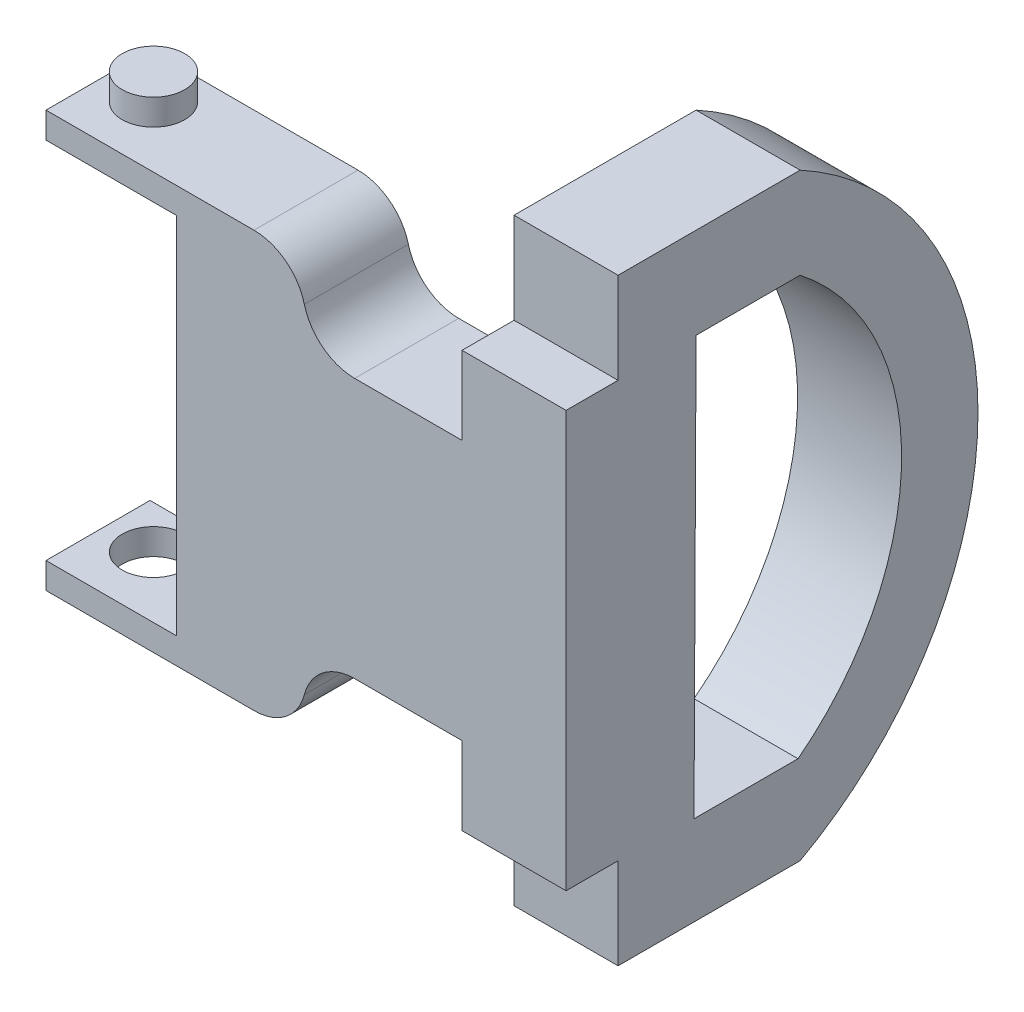
ISO-10303-21;
HEADER;
FILE_DESCRIPTION(('STEP AP214'),'2;1');
FILE_NAME('part.step','',(''),(''),'','','');
FILE_SCHEMA(('AUTOMOTIVE_DESIGN { 1 0 10303 214 1 1 1 1 }'));
ENDSEC;
DATA;
#1=APPLICATION_CONTEXT('core data for automotive mechanical design processes');
#2=APPLICATION_PROTOCOL_DEFINITION('international standard','automotive_design',2000,#1);
#3=PRODUCT_CONTEXT('',#1,'mechanical');
#4=PRODUCT('Part','Part','',(#3));
#5=PRODUCT_RELATED_PRODUCT_CATEGORY('part','',(#4));
#6=PRODUCT_DEFINITION_FORMATION('','',#4);
#7=PRODUCT_DEFINITION_CONTEXT('part definition',#1,'design');
#8=PRODUCT_DEFINITION('design','',#6,#7);
#9=PRODUCT_DEFINITION_SHAPE('','',#8);
#10=(LENGTH_UNIT() NAMED_UNIT(*) SI_UNIT(.MILLI.,.METRE.));
#11=(NAMED_UNIT(*) PLANE_ANGLE_UNIT() SI_UNIT($,.RADIAN.));
#12=(NAMED_UNIT(*) SI_UNIT($,.STERADIAN.) SOLID_ANGLE_UNIT());
#13=UNCERTAINTY_MEASURE_WITH_UNIT(LENGTH_MEASURE(1.E-05),#10,'distance_accuracy_value','');
#14=(GEOMETRIC_REPRESENTATION_CONTEXT(3) GLOBAL_UNCERTAINTY_ASSIGNED_CONTEXT((#13)) GLOBAL_UNIT_ASSIGNED_CONTEXT((#10,
#11,#12)) REPRESENTATION_CONTEXT('',''));
#15=CARTESIAN_POINT('',(0.,0.,0.));
#16=DIRECTION('',(0.,0.,1.));
#17=DIRECTION('',(1.,0.,0.));
#18=AXIS2_PLACEMENT_3D('',#15,#16,#17);
#19=CARTESIAN_POINT('',(20.,-17.6610059550138,-10.));
#20=DIRECTION('',(0.,-1.,0.));
#21=DIRECTION('',(0.,0.,-1.));
#22=AXIS2_PLACEMENT_3D('',#19,#20,#21);
#23=PLANE('',#22);
#24=DIRECTION('',(0.,0.,1.));
#25=VECTOR('',#24,1.);
#26=CARTESIAN_POINT('',(0.,-17.6610059550138,-10.));
#27=LINE('',#26,#25);
#28=CARTESIAN_POINT('',(0.,-17.6610059550138,-10.));
#29=VERTEX_POINT('',#28);
#30=CARTESIAN_POINT('',(0.,-17.6610059550138,0.));
#31=VERTEX_POINT('',#30);
#32=EDGE_CURVE('E394',#29,#31,#27,.T.);
#33=ORIENTED_EDGE('',*,*,#32,.T.);
#34=DIRECTION('',(-1.,0.,0.));
#35=VECTOR('',#34,1.);
#36=CARTESIAN_POINT('',(20.,-17.6610059550138,0.));
#37=LINE('',#36,#35);
#38=CARTESIAN_POINT('',(20.,-17.6610059550138,0.));
#39=VERTEX_POINT('',#38);
#40=EDGE_CURVE('E486',#39,#31,#37,.T.);
#41=ORIENTED_EDGE('',*,*,#40,.F.);
#42=DIRECTION('',(0.,0.,1.));
#43=VECTOR('',#42,1.);
#44=CARTESIAN_POINT('',(20.,-17.6610059550138,-10.));
#45=LINE('',#44,#43);
#46=CARTESIAN_POINT('',(20.,-17.6610059550138,-10.));
#47=VERTEX_POINT('',#46);
#48=EDGE_CURVE('E404',#47,#39,#45,.T.);
#49=ORIENTED_EDGE('',*,*,#48,.F.);
#50=DIRECTION('',(-1.,0.,0.));
#51=VECTOR('',#50,1.);
#52=CARTESIAN_POINT('',(20.,-17.6610059550138,-10.));
#53=LINE('',#52,#51);
#54=EDGE_CURVE('E434',#47,#29,#53,.T.);
#55=ORIENTED_EDGE('',*,*,#54,.T.);
#56=EDGE_LOOP('',(#33,#41,#49,#55));
#57=FACE_BOUND('',#56,.T.);
#58=ADVANCED_FACE('F42',(#57),#23,.F.);
#59=CARTESIAN_POINT('',(20.,-17.6610059550138,0.));
#60=DIRECTION('',(0.,0.,-1.));
#61=DIRECTION('',(0.,1.,0.));
#62=AXIS2_PLACEMENT_3D('',#59,#60,#61);
#63=PLANE('',#62);
#64=DIRECTION('',(0.00442729320585626,-0.99999019948941,0.));
#65=VECTOR('',#64,1.);
#66=CARTESIAN_POINT('',(-80.0000000000002,-17.6610059550114,0.));
#67=LINE('',#66,#65);
#68=CARTESIAN_POINT('',(-80.0000000000002,-17.6610059550114,0.));
#69=VERTEX_POINT('',#68);
#70=CARTESIAN_POINT('',(-79.9778633170201,-22.6610059550114,0.));
#71=VERTEX_POINT('',#70);
#72=EDGE_CURVE('E232',#69,#71,#67,.T.);
#73=ORIENTED_EDGE('',*,*,#72,.T.);
#74=DIRECTION('',(-1.,0.,0.));
#75=VECTOR('',#74,1.);
#76=CARTESIAN_POINT('',(-83.4960278519465,-22.6610059550114,0.));
#77=LINE('',#76,#75);
#78=CARTESIAN_POINT('',(-54.9335906019123,-22.6610059550114,0.));
#79=VERTEX_POINT('',#78);
#80=EDGE_CURVE('E226',#79,#71,#77,.T.);
#81=ORIENTED_EDGE('',*,*,#80,.F.);
#82=DIRECTION('',(0.,1.,0.));
#83=VECTOR('',#82,1.);
#84=CARTESIAN_POINT('',(-54.9335906019123,-82.6610059549785,0.));
#85=LINE('',#84,#83);
#86=CARTESIAN_POINT('',(-54.9335906019123,-92.6610059550144,0.));
#87=VERTEX_POINT('',#86);
#88=EDGE_CURVE('E219',#87,#79,#85,.T.);
#89=ORIENTED_EDGE('',*,*,#88,.F.);
#90=DIRECTION('',(1.,0.,0.));
#91=VECTOR('',#90,1.);
#92=CARTESIAN_POINT('',(-84.9059264365906,-92.6610059550144,0.));
#93=LINE('',#92,#91);
#94=CARTESIAN_POINT('',(-80.,-92.6610059550144,0.));
#95=VERTEX_POINT('',#94);
#96=EDGE_CURVE('E224',#95,#87,#93,.T.);
#97=ORIENTED_EDGE('',*,*,#96,.F.);
#98=DIRECTION('',(0.,-1.,0.));
#99=VECTOR('',#98,1.);
#100=CARTESIAN_POINT('',(-80.,-82.6610059549786,0.));
#101=LINE('',#100,#99);
#102=CARTESIAN_POINT('',(-80.,-97.6610059550144,0.));
#103=VERTEX_POINT('',#102);
#104=EDGE_CURVE('E231',#95,#103,#101,.T.);
#105=ORIENTED_EDGE('',*,*,#104,.T.);
#106=DIRECTION('',(-1.,0.,0.));
#107=VECTOR('',#106,1.);
#108=CARTESIAN_POINT('',(-40.6399999999999,-97.6610059550138,0.));
#109=LINE('',#108,#107);
#110=CARTESIAN_POINT('',(-40.0049167310368,-97.6610059550137,0.));
#111=VERTEX_POINT('',#110);
#112=EDGE_CURVE('E319',#111,#103,#109,.T.);
#113=ORIENTED_EDGE('',*,*,#112,.F.);
#114=CARTESIAN_POINT('',(-40.004916731037,-87.6610059550138,0.));
#115=DIRECTION('',(0.,0.,-1.));
#116=DIRECTION('',(0.,1.,0.));
#117=AXIS2_PLACEMENT_3D('',#114,#115,#116);
#118=CIRCLE('',#117,10.);
#119=CARTESIAN_POINT('',(-30.3224583655184,-90.1610059550138,0.));
#120=VERTEX_POINT('',#119);
#121=EDGE_CURVE('E68',#111,#120,#118,.F.);
#122=ORIENTED_EDGE('',*,*,#121,.T.);
#123=CARTESIAN_POINT('',(-20.6399999999999,-92.6610059550138,0.));
#124=DIRECTION('',(0.,0.,1.));
#125=DIRECTION('',(1.,0.,0.));
#126=AXIS2_PLACEMENT_3D('',#123,#124,#125);
#127=CIRCLE('',#126,10.);
#128=CARTESIAN_POINT('',(-20.64,-82.6610059550138,0.));
#129=VERTEX_POINT('',#128);
#130=EDGE_CURVE('E323',#129,#120,#127,.T.);
#131=ORIENTED_EDGE('',*,*,#130,.F.);
#132=DIRECTION('',(1.,0.,0.));
#133=VECTOR('',#132,1.);
#134=CARTESIAN_POINT('',(-20.64,-82.6610059550138,0.));
#135=LINE('',#134,#133);
#136=CARTESIAN_POINT('',(0.,-82.6610059550138,0.));
#137=VERTEX_POINT('',#136);
#138=EDGE_CURVE('E326',#129,#137,#135,.T.);
#139=ORIENTED_EDGE('',*,*,#138,.T.);
#140=DIRECTION('',(0.,-1.,0.));
#141=VECTOR('',#140,1.);
#142=CARTESIAN_POINT('',(0.,-17.6610059550138,0.));
#143=LINE('',#142,#141);
#144=CARTESIAN_POINT('',(0.,-97.6610059550138,0.));
#145=VERTEX_POINT('',#144);
#146=EDGE_CURVE('E437',#137,#145,#143,.T.);
#147=ORIENTED_EDGE('',*,*,#146,.T.);
#148=DIRECTION('',(-1.,0.,0.));
#149=VECTOR('',#148,1.);
#150=CARTESIAN_POINT('',(20.,-97.6610059550138,0.));
#151=LINE('',#150,#149);
#152=CARTESIAN_POINT('',(20.,-97.6610059550138,0.));
#153=VERTEX_POINT('',#152);
#154=EDGE_CURVE('E482',#153,#145,#151,.T.);
#155=ORIENTED_EDGE('',*,*,#154,.F.);
#156=DIRECTION('',(0.,-1.,0.));
#157=VECTOR('',#156,1.);
#158=CARTESIAN_POINT('',(20.,-17.6610059550138,0.));
#159=LINE('',#158,#157);
#160=EDGE_CURVE('E408',#39,#153,#159,.T.);
#161=ORIENTED_EDGE('',*,*,#160,.F.);
#162=ORIENTED_EDGE('',*,*,#40,.T.);
#163=CARTESIAN_POINT('',(0.,-32.6610059550114,0.));
#164=VERTEX_POINT('',#163);
#165=EDGE_CURVE('E438',#31,#164,#143,.T.);
#166=ORIENTED_EDGE('',*,*,#165,.T.);
#167=DIRECTION('',(-1.,0.,0.));
#168=VECTOR('',#167,1.);
#169=CARTESIAN_POINT('',(0.,-32.6610059550114,0.));
#170=LINE('',#169,#168);
#171=CARTESIAN_POINT('',(-20.6400000000002,-32.6610059550114,0.));
#172=VERTEX_POINT('',#171);
#173=EDGE_CURVE('E329',#164,#172,#170,.T.);
#174=ORIENTED_EDGE('',*,*,#173,.T.);
#175=CARTESIAN_POINT('',(-20.6400000000002,-22.6610059550114,0.));
#176=DIRECTION('',(0.,0.,-1.));
#177=DIRECTION('',(-1.,0.,0.));
#178=AXIS2_PLACEMENT_3D('',#175,#176,#177);
#179=CIRCLE('',#178,10.);
#180=CARTESIAN_POINT('',(-30.3224583655188,-25.1610059550114,0.));
#181=VERTEX_POINT('',#180);
#182=EDGE_CURVE('E333',#172,#181,#179,.T.);
#183=ORIENTED_EDGE('',*,*,#182,.T.);
#184=CARTESIAN_POINT('',(-40.0049167310373,-27.6610059550114,0.));
#185=DIRECTION('',(0.,0.,-1.));
#186=DIRECTION('',(0.,1.,0.));
#187=AXIS2_PLACEMENT_3D('',#184,#185,#186);
#188=CIRCLE('',#187,10.);
#189=CARTESIAN_POINT('',(-40.0049167310373,-17.6610059550114,0.));
#190=VERTEX_POINT('',#189);
#191=EDGE_CURVE('E498',#181,#190,#188,.F.);
#192=ORIENTED_EDGE('',*,*,#191,.T.);
#193=DIRECTION('',(1.,0.,0.));
#194=VECTOR('',#193,1.);
#195=CARTESIAN_POINT('',(-80.0000000000002,-17.6610059550114,0.));
#196=LINE('',#195,#194);
#197=EDGE_CURVE('E285',#69,#190,#196,.T.);
#198=ORIENTED_EDGE('',*,*,#197,.F.);
#199=EDGE_LOOP('',(#73,#81,#89,#97,#105,#113,#122,#131,#139,#147,#155,#161,#162,#166,#174,#183,
#192,#198));
#200=FACE_BOUND('',#199,.T.);
#201=ADVANCED_FACE('F222',(#200),#63,.F.);
#202=CARTESIAN_POINT('',(20.,-97.6610059550138,-10.));
#203=DIRECTION('',(0.,-1.,0.));
#204=DIRECTION('',(0.,0.,-1.));
#205=AXIS2_PLACEMENT_3D('',#202,#203,#204);
#206=PLANE('',#205);
#207=DIRECTION('',(0.,0.,1.));
#208=VECTOR('',#207,1.);
#209=CARTESIAN_POINT('',(0.,-97.6610059550138,-10.));
#210=LINE('',#209,#208);
#211=CARTESIAN_POINT('',(0.,-97.6610059550138,-10.));
#212=VERTEX_POINT('',#211);
#213=EDGE_CURVE('E442',#212,#145,#210,.T.);
#214=ORIENTED_EDGE('',*,*,#213,.F.);
#215=DIRECTION('',(-1.,0.,0.));
#216=VECTOR('',#215,1.);
#217=CARTESIAN_POINT('',(20.,-97.6610059550138,-10.));
#218=LINE('',#217,#216);
#219=CARTESIAN_POINT('',(20.,-97.6610059550138,-10.));
#220=VERTEX_POINT('',#219);
#221=EDGE_CURVE('E479',#220,#212,#218,.T.);
#222=ORIENTED_EDGE('',*,*,#221,.F.);
#223=DIRECTION('',(0.,0.,1.));
#224=VECTOR('',#223,1.);
#225=CARTESIAN_POINT('',(20.,-97.6610059550138,-10.));
#226=LINE('',#225,#224);
#227=EDGE_CURVE('E412',#220,#153,#226,.T.);
#228=ORIENTED_EDGE('',*,*,#227,.T.);
#229=ORIENTED_EDGE('',*,*,#154,.T.);
#230=EDGE_LOOP('',(#214,#222,#228,#229));
#231=FACE_BOUND('',#230,.T.);
#232=ADVANCED_FACE('F543',(#231),#206,.T.);
#233=CARTESIAN_POINT('',(20.,-115.161005955014,-10.));
#234=DIRECTION('',(0.,0.,1.));
#235=DIRECTION('',(1.,0.,0.));
#236=AXIS2_PLACEMENT_3D('',#233,#234,#235);
#237=PLANE('',#236);
#238=DIRECTION('',(0.,1.,0.));
#239=VECTOR('',#238,1.);
#240=CARTESIAN_POINT('',(0.,-115.161005955014,-10.));
#241=LINE('',#240,#239);
#242=CARTESIAN_POINT('',(0.,-115.161005955014,-10.));
#243=VERTEX_POINT('',#242);
#244=EDGE_CURVE('E446',#243,#212,#241,.T.);
#245=ORIENTED_EDGE('',*,*,#244,.F.);
#246=DIRECTION('',(-1.,0.,0.));
#247=VECTOR('',#246,1.);
#248=CARTESIAN_POINT('',(20.,-115.161005955014,-10.));
#249=LINE('',#248,#247);
#250=CARTESIAN_POINT('',(20.,-115.161005955014,-10.));
#251=VERTEX_POINT('',#250);
#252=EDGE_CURVE('E476',#251,#243,#249,.T.);
#253=ORIENTED_EDGE('',*,*,#252,.F.);
#254=DIRECTION('',(0.,1.,0.));
#255=VECTOR('',#254,1.);
#256=CARTESIAN_POINT('',(20.,-115.161005955014,-10.));
#257=LINE('',#256,#255);
#258=EDGE_CURVE('E416',#251,#220,#257,.T.);
#259=ORIENTED_EDGE('',*,*,#258,.T.);
#260=ORIENTED_EDGE('',*,*,#221,.T.);
#261=EDGE_LOOP('',(#245,#253,#259,#260));
#262=FACE_BOUND('',#261,.T.);
#263=ADVANCED_FACE('F659',(#262),#237,.T.);
#264=CARTESIAN_POINT('',(20.,-115.161005955014,-10.));
#265=DIRECTION('',(0.,1.,0.));
#266=DIRECTION('',(0.,0.,1.));
#267=AXIS2_PLACEMENT_3D('',#264,#265,#266);
#268=PLANE('',#267);
#269=DIRECTION('',(0.,0.,-1.));
#270=VECTOR('',#269,1.);
#271=CARTESIAN_POINT('',(0.,-115.161005955014,-10.));
#272=LINE('',#271,#270);
#273=CARTESIAN_POINT('',(0.,-115.161005955014,-45.));
#274=VERTEX_POINT('',#273);
#275=EDGE_CURVE('E450',#243,#274,#272,.T.);
#276=ORIENTED_EDGE('',*,*,#275,.T.);
#277=DIRECTION('',(-1.,0.,0.));
#278=VECTOR('',#277,1.);
#279=CARTESIAN_POINT('',(20.,-115.161005955014,-45.));
#280=LINE('',#279,#278);
#281=CARTESIAN_POINT('',(20.,-115.161005955014,-45.));
#282=VERTEX_POINT('',#281);
#283=EDGE_CURVE('E473',#282,#274,#280,.T.);
#284=ORIENTED_EDGE('',*,*,#283,.F.);
#285=DIRECTION('',(0.,0.,-1.));
#286=VECTOR('',#285,1.);
#287=CARTESIAN_POINT('',(20.,-115.161005955014,-10.));
#288=LINE('',#287,#286);
#289=EDGE_CURVE('E420',#251,#282,#288,.T.);
#290=ORIENTED_EDGE('',*,*,#289,.F.);
#291=ORIENTED_EDGE('',*,*,#252,.T.);
#292=EDGE_LOOP('',(#276,#284,#290,#291));
#293=FACE_BOUND('',#292,.T.);
#294=ADVANCED_FACE('F655',(#293),#268,.F.);
#295=CARTESIAN_POINT('',(20.,-57.6610059550138,-13.7776538357541));
#296=DIRECTION('',(-1.,0.,0.));
#297=DIRECTION('',(0.,0.,1.));
#298=AXIS2_PLACEMENT_3D('',#295,#296,#297);
#299=CYLINDRICAL_SURFACE('',#298,65.43);
#300=CARTESIAN_POINT('',(0.,-57.6610059550138,-13.7776538357541));
#301=DIRECTION('',(-1.,0.,0.));
#302=DIRECTION('',(0.,0.,1.));
#303=AXIS2_PLACEMENT_3D('',#300,#301,#302);
#304=CIRCLE('',#303,65.43);
#305=CARTESIAN_POINT('',(0.,-0.161005955013768,-45.));
#306=VERTEX_POINT('',#305);
#307=EDGE_CURVE('E454',#306,#274,#304,.T.);
#308=ORIENTED_EDGE('',*,*,#307,.F.);
#309=DIRECTION('',(-1.,0.,0.));
#310=VECTOR('',#309,1.);
#311=CARTESIAN_POINT('',(20.,-0.161005955013768,-45.));
#312=LINE('',#311,#310);
#313=CARTESIAN_POINT('',(20.,-0.161005955013768,-45.));
#314=VERTEX_POINT('',#313);
#315=EDGE_CURVE('E470',#314,#306,#312,.T.);
#316=ORIENTED_EDGE('',*,*,#315,.F.);
#317=CARTESIAN_POINT('',(20.,-57.6610059550138,-13.7776538357541));
#318=DIRECTION('',(-1.,0.,0.));
#319=DIRECTION('',(0.,0.,1.));
#320=AXIS2_PLACEMENT_3D('',#317,#318,#319);
#321=CIRCLE('',#320,65.43);
#322=EDGE_CURVE('E423',#314,#282,#321,.T.);
#323=ORIENTED_EDGE('',*,*,#322,.T.);
#324=ORIENTED_EDGE('',*,*,#283,.T.);
#325=EDGE_LOOP('',(#308,#316,#323,#324));
#326=FACE_BOUND('',#325,.T.);
#327=ADVANCED_FACE('F651',(#326),#299,.T.);
#328=CARTESIAN_POINT('',(20.,-0.161005955013768,-10.));
#329=DIRECTION('',(0.,1.,0.));
#330=DIRECTION('',(0.,0.,1.));
#331=AXIS2_PLACEMENT_3D('',#328,#329,#330);
#332=PLANE('',#331);
#333=DIRECTION('',(0.,0.,-1.));
#334=VECTOR('',#333,1.);
#335=CARTESIAN_POINT('',(0.,-0.161005955013768,-10.));
#336=LINE('',#335,#334);
#337=CARTESIAN_POINT('',(0.,-0.161005955013768,-10.));
#338=VERTEX_POINT('',#337);
#339=EDGE_CURVE('E458',#338,#306,#336,.T.);
#340=ORIENTED_EDGE('',*,*,#339,.F.);
#341=DIRECTION('',(-1.,0.,0.));
#342=VECTOR('',#341,1.);
#343=CARTESIAN_POINT('',(20.,-0.161005955013768,-10.));
#344=LINE('',#343,#342);
#345=CARTESIAN_POINT('',(20.,-0.161005955013768,-10.));
#346=VERTEX_POINT('',#345);
#347=EDGE_CURVE('E467',#346,#338,#344,.T.);
#348=ORIENTED_EDGE('',*,*,#347,.F.);
#349=DIRECTION('',(0.,0.,-1.));
#350=VECTOR('',#349,1.);
#351=CARTESIAN_POINT('',(20.,-0.161005955013768,-10.));
#352=LINE('',#351,#350);
#353=EDGE_CURVE('E427',#346,#314,#352,.T.);
#354=ORIENTED_EDGE('',*,*,#353,.T.);
#355=ORIENTED_EDGE('',*,*,#315,.T.);
#356=EDGE_LOOP('',(#340,#348,#354,#355));
#357=FACE_BOUND('',#356,.T.);
#358=ADVANCED_FACE('F647',(#357),#332,.T.);
#359=CARTESIAN_POINT('',(20.,-0.161005955013768,-10.));
#360=DIRECTION('',(0.,0.,-1.));
#361=DIRECTION('',(0.,1.,0.));
#362=AXIS2_PLACEMENT_3D('',#359,#360,#361);
#363=PLANE('',#362);
#364=DIRECTION('',(0.,-1.,0.));
#365=VECTOR('',#364,1.);
#366=CARTESIAN_POINT('',(0.,-0.161005955013768,-10.));
#367=LINE('',#366,#365);
#368=EDGE_CURVE('E409',#338,#29,#367,.T.);
#369=ORIENTED_EDGE('',*,*,#368,.T.);
#370=ORIENTED_EDGE('',*,*,#54,.F.);
#371=DIRECTION('',(0.,-1.,0.));
#372=VECTOR('',#371,1.);
#373=CARTESIAN_POINT('',(20.,-0.161005955013768,-10.));
#374=LINE('',#373,#372);
#375=EDGE_CURVE('E431',#346,#47,#374,.T.);
#376=ORIENTED_EDGE('',*,*,#375,.F.);
#377=ORIENTED_EDGE('',*,*,#347,.T.);
#378=EDGE_LOOP('',(#369,#370,#376,#377));
#379=FACE_BOUND('',#378,.T.);
#380=ADVANCED_FACE('F641',(#379),#363,.F.);
#381=CARTESIAN_POINT('',(20.,-57.6610059550138,-13.7776538357541));
#382=DIRECTION('',(-1.,0.,0.));
#383=DIRECTION('',(0.,0.,1.));
#384=AXIS2_PLACEMENT_3D('',#381,#382,#383);
#385=PLANE('',#384);
#386=ORIENTED_EDGE('',*,*,#227,.F.);
#387=ORIENTED_EDGE('',*,*,#258,.F.);
#388=ORIENTED_EDGE('',*,*,#289,.T.);
#389=ORIENTED_EDGE('',*,*,#322,.F.);
#390=ORIENTED_EDGE('',*,*,#353,.F.);
#391=ORIENTED_EDGE('',*,*,#375,.T.);
#392=ORIENTED_EDGE('',*,*,#48,.T.);
#393=ORIENTED_EDGE('',*,*,#160,.T.);
#394=EDGE_LOOP('',(#386,#387,#388,#389,#390,#391,#392,#393));
#395=FACE_BOUND('',#394,.T.);
#396=DIRECTION('',(0.,0.,-1.));
#397=VECTOR('',#396,1.);
#398=CARTESIAN_POINT('',(20.,-97.970728365294,-44.5990940877306));
#399=LINE('',#398,#397);
#400=CARTESIAN_POINT('',(20.,-97.970728365294,-24.5990940877306));
#401=VERTEX_POINT('',#400);
#402=CARTESIAN_POINT('',(20.,-97.9707283652939,-44.5990940877306));
#403=VERTEX_POINT('',#402);
#404=EDGE_CURVE('E380',#401,#403,#399,.T.);
#405=ORIENTED_EDGE('',*,*,#404,.F.);
#406=DIRECTION('',(0.,-0.999987540214673,0.00499193503645428));
#407=VECTOR('',#406,1.);
#408=CARTESIAN_POINT('',(20.,-17.6610059550138,-25.));
#409=LINE('',#408,#407);
#410=CARTESIAN_POINT('',(20.,-17.6610059550138,-25.));
#411=VERTEX_POINT('',#410);
#412=EDGE_CURVE('E342',#411,#401,#409,.T.);
#413=ORIENTED_EDGE('',*,*,#412,.F.);
#414=DIRECTION('',(0.,0.,1.));
#415=VECTOR('',#414,1.);
#416=CARTESIAN_POINT('',(20.,-17.6610059550138,-45.));
#417=LINE('',#416,#415);
#418=CARTESIAN_POINT('',(20.,-17.6610059550138,-45.));
#419=VERTEX_POINT('',#418);
#420=EDGE_CURVE('E365',#419,#411,#417,.T.);
#421=ORIENTED_EDGE('',*,*,#420,.F.);
#422=CARTESIAN_POINT('',(20.,-57.6610059550138,-13.7776538357541));
#423=DIRECTION('',(1.,0.,0.));
#424=DIRECTION('',(0.,0.,1.));
#425=AXIS2_PLACEMENT_3D('',#422,#423,#424);
#426=CIRCLE('',#425,50.7428310207462);
#427=EDGE_CURVE('E384',#403,#419,#426,.T.);
#428=ORIENTED_EDGE('',*,*,#427,.F.);
#429=EDGE_LOOP('',(#405,#413,#421,#428));
#430=FACE_BOUND('',#429,.T.);
#431=ADVANCED_FACE('F638',(#395,#430),#385,.F.);
#432=CARTESIAN_POINT('',(0.,-57.6610059550138,-13.7776538357541));
#433=DIRECTION('',(-1.,0.,0.));
#434=DIRECTION('',(0.,0.,1.));
#435=AXIS2_PLACEMENT_3D('',#432,#433,#434);
#436=PLANE('',#435);
#437=ORIENTED_EDGE('',*,*,#244,.T.);
#438=ORIENTED_EDGE('',*,*,#213,.T.);
#439=ORIENTED_EDGE('',*,*,#146,.F.);
#440=DIRECTION('',(0.,0.,1.));
#441=VECTOR('',#440,1.);
#442=CARTESIAN_POINT('',(0.,-82.6610059550138,-20.));
#443=LINE('',#442,#441);
#444=CARTESIAN_POINT('',(0.,-82.6610059550138,-20.));
#445=VERTEX_POINT('',#444);
#446=EDGE_CURVE('E350',#445,#137,#443,.T.);
#447=ORIENTED_EDGE('',*,*,#446,.F.);
#448=DIRECTION('',(0.,1.,0.));
#449=VECTOR('',#448,1.);
#450=CARTESIAN_POINT('',(0.,-57.6610059550138,-20.));
#451=LINE('',#450,#449);
#452=CARTESIAN_POINT('',(0.,-32.6610059550114,-20.));
#453=VERTEX_POINT('',#452);
#454=EDGE_CURVE('E490',#445,#453,#451,.T.);
#455=ORIENTED_EDGE('',*,*,#454,.T.);
#456=DIRECTION('',(0.,0.,1.));
#457=VECTOR('',#456,1.);
#458=CARTESIAN_POINT('',(0.,-32.6610059550114,-20.));
#459=LINE('',#458,#457);
#460=EDGE_CURVE('E346',#453,#164,#459,.T.);
#461=ORIENTED_EDGE('',*,*,#460,.T.);
#462=ORIENTED_EDGE('',*,*,#165,.F.);
#463=ORIENTED_EDGE('',*,*,#32,.F.);
#464=ORIENTED_EDGE('',*,*,#368,.F.);
#465=ORIENTED_EDGE('',*,*,#339,.T.);
#466=ORIENTED_EDGE('',*,*,#307,.T.);
#467=ORIENTED_EDGE('',*,*,#275,.F.);
#468=EDGE_LOOP('',(#437,#438,#439,#447,#455,#461,#462,#463,#464,#465,#466,#467));
#469=FACE_BOUND('',#468,.T.);
#470=DIRECTION('',(0.,-0.999987540214673,0.00499193503645428));
#471=VECTOR('',#470,1.);
#472=CARTESIAN_POINT('',(0.,-17.6610059550138,-25.));
#473=LINE('',#472,#471);
#474=CARTESIAN_POINT('',(0.,-17.6610059550138,-25.));
#475=VERTEX_POINT('',#474);
#476=CARTESIAN_POINT('',(0.,-97.970728365294,-24.5990940877306));
#477=VERTEX_POINT('',#476);
#478=EDGE_CURVE('E360',#475,#477,#473,.T.);
#479=ORIENTED_EDGE('',*,*,#478,.T.);
#480=DIRECTION('',(0.,0.,-1.));
#481=VECTOR('',#480,1.);
#482=CARTESIAN_POINT('',(0.,-97.970728365294,-44.5990940877306));
#483=LINE('',#482,#481);
#484=CARTESIAN_POINT('',(0.,-97.970728365294,-44.5990940877306));
#485=VERTEX_POINT('',#484);
#486=EDGE_CURVE('E364',#477,#485,#483,.T.);
#487=ORIENTED_EDGE('',*,*,#486,.T.);
#488=CARTESIAN_POINT('',(0.,-57.6610059550138,-13.7776538357541));
#489=DIRECTION('',(1.,0.,0.));
#490=DIRECTION('',(0.,0.,1.));
#491=AXIS2_PLACEMENT_3D('',#488,#489,#490);
#492=CIRCLE('',#491,50.7428310207462);
#493=CARTESIAN_POINT('',(0.,-17.6610059550138,-45.));
#494=VERTEX_POINT('',#493);
#495=EDGE_CURVE('E369',#485,#494,#492,.T.);
#496=ORIENTED_EDGE('',*,*,#495,.T.);
#497=DIRECTION('',(0.,0.,1.));
#498=VECTOR('',#497,1.);
#499=CARTESIAN_POINT('',(0.,-17.6610059550138,-45.));
#500=LINE('',#499,#498);
#501=EDGE_CURVE('E373',#494,#475,#500,.T.);
#502=ORIENTED_EDGE('',*,*,#501,.T.);
#503=EDGE_LOOP('',(#479,#487,#496,#502));
#504=FACE_BOUND('',#503,.T.);
#505=ADVANCED_FACE('F572',(#469,#504),#436,.T.);
#506=CARTESIAN_POINT('',(0.,-17.6610059550138,-25.));
#507=DIRECTION('',(0.,0.00499193503645428,0.999987540214673));
#508=DIRECTION('',(0.,-0.999987540214673,0.00499193503645429));
#509=AXIS2_PLACEMENT_3D('',#506,#507,#508);
#510=PLANE('',#509);
#511=ORIENTED_EDGE('',*,*,#412,.T.);
#512=DIRECTION('',(1.,0.,0.));
#513=VECTOR('',#512,1.);
#514=CARTESIAN_POINT('',(0.,-97.970728365294,-24.5990940877306));
#515=LINE('',#514,#513);
#516=EDGE_CURVE('E377',#477,#401,#515,.T.);
#517=ORIENTED_EDGE('',*,*,#516,.F.);
#518=ORIENTED_EDGE('',*,*,#478,.F.);
#519=DIRECTION('',(1.,0.,0.));
#520=VECTOR('',#519,1.);
#521=CARTESIAN_POINT('',(0.,-17.6610059550138,-25.));
#522=LINE('',#521,#520);
#523=EDGE_CURVE('E391',#475,#411,#522,.T.);
#524=ORIENTED_EDGE('',*,*,#523,.T.);
#525=EDGE_LOOP('',(#511,#517,#518,#524));
#526=FACE_BOUND('',#525,.T.);
#527=ADVANCED_FACE('F627',(#526),#510,.F.);
#528=CARTESIAN_POINT('',(0.,-17.6610059550138,-45.));
#529=DIRECTION('',(0.,1.,0.));
#530=DIRECTION('',(0.,0.,1.));
#531=AXIS2_PLACEMENT_3D('',#528,#529,#530);
#532=PLANE('',#531);
#533=ORIENTED_EDGE('',*,*,#420,.T.);
#534=ORIENTED_EDGE('',*,*,#523,.F.);
#535=ORIENTED_EDGE('',*,*,#501,.F.);
#536=DIRECTION('',(1.,0.,0.));
#537=VECTOR('',#536,1.);
#538=CARTESIAN_POINT('',(0.,-17.6610059550138,-45.));
#539=LINE('',#538,#537);
#540=EDGE_CURVE('E395',#494,#419,#539,.T.);
#541=ORIENTED_EDGE('',*,*,#540,.T.);
#542=EDGE_LOOP('',(#533,#534,#535,#541));
#543=FACE_BOUND('',#542,.T.);
#544=ADVANCED_FACE('F623',(#543),#532,.F.);
#545=CARTESIAN_POINT('',(0.,-57.6610059550138,-13.7776538357541));
#546=DIRECTION('',(1.,0.,0.));
#547=DIRECTION('',(0.,0.,-1.));
#548=AXIS2_PLACEMENT_3D('',#545,#546,#547);
#549=CYLINDRICAL_SURFACE('',#548,50.7428310207462);
#550=ORIENTED_EDGE('',*,*,#427,.T.);
#551=ORIENTED_EDGE('',*,*,#540,.F.);
#552=ORIENTED_EDGE('',*,*,#495,.F.);
#553=DIRECTION('',(1.,0.,0.));
#554=VECTOR('',#553,1.);
#555=CARTESIAN_POINT('',(0.,-97.9707283652939,-44.5990940877306));
#556=LINE('',#555,#554);
#557=EDGE_CURVE('E398',#485,#403,#556,.T.);
#558=ORIENTED_EDGE('',*,*,#557,.T.);
#559=EDGE_LOOP('',(#550,#551,#552,#558));
#560=FACE_BOUND('',#559,.T.);
#561=ADVANCED_FACE('F626',(#560),#549,.F.);
#562=CARTESIAN_POINT('',(0.,-97.970728365294,-44.5990940877306));
#563=DIRECTION('',(0.,-1.,0.));
#564=DIRECTION('',(0.,0.,-1.));
#565=AXIS2_PLACEMENT_3D('',#562,#563,#564);
#566=PLANE('',#565);
#567=ORIENTED_EDGE('',*,*,#404,.T.);
#568=ORIENTED_EDGE('',*,*,#557,.F.);
#569=ORIENTED_EDGE('',*,*,#486,.F.);
#570=ORIENTED_EDGE('',*,*,#516,.T.);
#571=EDGE_LOOP('',(#567,#568,#569,#570));
#572=FACE_BOUND('',#571,.T.);
#573=ADVANCED_FACE('F604',(#572),#566,.F.);
#574=CARTESIAN_POINT('',(-80.0000000000002,-17.6610059550114,-20.));
#575=DIRECTION('',(-0.99999019948941,-0.00442729320585626,0.));
#576=DIRECTION('',(0.00442729320585626,-0.99999019948941,0.));
#577=AXIS2_PLACEMENT_3D('',#574,#575,#576);
#578=PLANE('',#577);
#579=DIRECTION('',(0.,0.,-1.));
#580=VECTOR('',#579,1.);
#581=CARTESIAN_POINT('',(-79.9778633170201,-22.6610059550114,-20.));
#582=LINE('',#581,#580);
#583=CARTESIAN_POINT('',(-79.9778633170201,-22.6610059550114,-20.));
#584=VERTEX_POINT('',#583);
#585=EDGE_CURVE('E266',#71,#584,#582,.T.);
#586=ORIENTED_EDGE('',*,*,#585,.F.);
#587=ORIENTED_EDGE('',*,*,#72,.F.);
#588=DIRECTION('',(0.,0.,1.));
#589=VECTOR('',#588,1.);
#590=CARTESIAN_POINT('',(-80.0000000000002,-17.6610059550114,-20.));
#591=LINE('',#590,#589);
#592=CARTESIAN_POINT('',(-80.0000000000002,-17.6610059550114,-20.));
#593=VERTEX_POINT('',#592);
#594=EDGE_CURVE('E339',#593,#69,#591,.T.);
#595=ORIENTED_EDGE('',*,*,#594,.F.);
#596=DIRECTION('',(0.00442729320585626,-0.99999019948941,0.));
#597=VECTOR('',#596,1.);
#598=CARTESIAN_POINT('',(-80.0000000000002,-17.6610059550114,-20.));
#599=LINE('',#598,#597);
#600=EDGE_CURVE('E281',#593,#584,#599,.T.);
#601=ORIENTED_EDGE('',*,*,#600,.T.);
#602=EDGE_LOOP('',(#586,#587,#595,#601));
#603=FACE_BOUND('',#602,.T.);
#604=ADVANCED_FACE('F592',(#603),#578,.T.);
#605=CARTESIAN_POINT('',(-80.0000000000002,-17.6610059550114,-20.));
#606=DIRECTION('',(0.,-1.,0.));
#607=DIRECTION('',(0.,0.,-1.));
#608=AXIS2_PLACEMENT_3D('',#605,#606,#607);
#609=PLANE('',#608);
#610=CARTESIAN_POINT('',(-71.0719727186984,-17.6610059550114,-11.7357102533902));
#611=DIRECTION('',(0.,-1.,0.));
#612=DIRECTION('',(0.,0.,-1.));
#613=AXIS2_PLACEMENT_3D('',#610,#611,#612);
#614=CIRCLE('',#613,6.01109512246011);
#615=CARTESIAN_POINT('',(-71.0719727186984,-17.6610059550114,-17.7468053758503));
#616=VERTEX_POINT('',#615);
#617=EDGE_CURVE('E11',#616,#616,#614,.F.);
#618=ORIENTED_EDGE('',*,*,#617,.F.);
#619=EDGE_LOOP('',(#618));
#620=FACE_BOUND('',#619,.T.);
#621=ORIENTED_EDGE('',*,*,#197,.T.);
#622=DIRECTION('',(0.,0.,-1.));
#623=VECTOR('',#622,1.);
#624=CARTESIAN_POINT('',(-40.0049167310373,-17.6610059550114,-20.));
#625=LINE('',#624,#623);
#626=CARTESIAN_POINT('',(-40.0049167310373,-17.6610059550114,-20.));
#627=VERTEX_POINT('',#626);
#628=EDGE_CURVE('E501',#190,#627,#625,.T.);
#629=ORIENTED_EDGE('',*,*,#628,.T.);
#630=DIRECTION('',(1.,0.,0.));
#631=VECTOR('',#630,1.);
#632=CARTESIAN_POINT('',(-80.0000000000002,-17.6610059550114,-20.));
#633=LINE('',#632,#631);
#634=EDGE_CURVE('E310',#593,#627,#633,.T.);
#635=ORIENTED_EDGE('',*,*,#634,.F.);
#636=ORIENTED_EDGE('',*,*,#594,.T.);
#637=EDGE_LOOP('',(#621,#629,#635,#636));
#638=FACE_BOUND('',#637,.T.);
#639=ADVANCED_FACE('F595',(#620,#638),#609,.F.);
#640=CARTESIAN_POINT('',(-20.6400000000002,-22.6610059550114,-20.));
#641=DIRECTION('',(0.,0.,1.));
#642=DIRECTION('',(1.,0.,0.));
#643=AXIS2_PLACEMENT_3D('',#640,#641,#642);
#644=CYLINDRICAL_SURFACE('',#643,10.);
#645=CARTESIAN_POINT('',(-20.6400000000002,-22.6610059550114,-20.));
#646=DIRECTION('',(0.,0.,-1.));
#647=DIRECTION('',(-1.,0.,0.));
#648=AXIS2_PLACEMENT_3D('',#645,#646,#647);
#649=CIRCLE('',#648,10.);
#650=CARTESIAN_POINT('',(-20.6400000000002,-32.6610059550114,-20.));
#651=VERTEX_POINT('',#650);
#652=CARTESIAN_POINT('',(-30.3224583655188,-25.1610059550114,-20.));
#653=VERTEX_POINT('',#652);
#654=EDGE_CURVE('E306',#651,#653,#649,.T.);
#655=ORIENTED_EDGE('',*,*,#654,.T.);
#656=DIRECTION('',(0.,0.,1.));
#657=VECTOR('',#656,1.);
#658=CARTESIAN_POINT('',(-30.3224583655188,-25.1610059550114,-20.));
#659=LINE('',#658,#657);
#660=EDGE_CURVE('E494',#653,#181,#659,.T.);
#661=ORIENTED_EDGE('',*,*,#660,.T.);
#662=ORIENTED_EDGE('',*,*,#182,.F.);
#663=DIRECTION('',(0.,0.,1.));
#664=VECTOR('',#663,1.);
#665=CARTESIAN_POINT('',(-20.6400000000002,-32.6610059550114,-20.));
#666=LINE('',#665,#664);
#667=EDGE_CURVE('E343',#651,#172,#666,.T.);
#668=ORIENTED_EDGE('',*,*,#667,.F.);
#669=EDGE_LOOP('',(#655,#661,#662,#668));
#670=FACE_BOUND('',#669,.T.);
#671=ADVANCED_FACE('F565',(#670),#644,.F.);
#672=CARTESIAN_POINT('',(0.,-32.6610059550114,-20.));
#673=DIRECTION('',(0.,1.,0.));
#674=DIRECTION('',(0.,0.,1.));
#675=AXIS2_PLACEMENT_3D('',#672,#673,#674);
#676=PLANE('',#675);
#677=ORIENTED_EDGE('',*,*,#173,.F.);
#678=ORIENTED_EDGE('',*,*,#460,.F.);
#679=DIRECTION('',(-1.,0.,0.));
#680=VECTOR('',#679,1.);
#681=CARTESIAN_POINT('',(0.,-32.6610059550114,-20.));
#682=LINE('',#681,#680);
#683=EDGE_CURVE('E302',#453,#651,#682,.T.);
#684=ORIENTED_EDGE('',*,*,#683,.T.);
#685=ORIENTED_EDGE('',*,*,#667,.T.);
#686=EDGE_LOOP('',(#677,#678,#684,#685));
#687=FACE_BOUND('',#686,.T.);
#688=ADVANCED_FACE('F568',(#687),#676,.T.);
#689=CARTESIAN_POINT('',(-20.64,-82.6610059550138,-20.));
#690=DIRECTION('',(0.,-1.,0.));
#691=DIRECTION('',(0.,0.,-1.));
#692=AXIS2_PLACEMENT_3D('',#689,#690,#691);
#693=PLANE('',#692);
#694=ORIENTED_EDGE('',*,*,#138,.F.);
#695=DIRECTION('',(0.,0.,1.));
#696=VECTOR('',#695,1.);
#697=CARTESIAN_POINT('',(-20.64,-82.6610059550138,-20.));
#698=LINE('',#697,#696);
#699=CARTESIAN_POINT('',(-20.64,-82.6610059550138,-20.));
#700=VERTEX_POINT('',#699);
#701=EDGE_CURVE('E354',#700,#129,#698,.T.);
#702=ORIENTED_EDGE('',*,*,#701,.F.);
#703=DIRECTION('',(1.,0.,0.));
#704=VECTOR('',#703,1.);
#705=CARTESIAN_POINT('',(-20.64,-82.6610059550138,-20.));
#706=LINE('',#705,#704);
#707=EDGE_CURVE('E298',#700,#445,#706,.T.);
#708=ORIENTED_EDGE('',*,*,#707,.T.);
#709=ORIENTED_EDGE('',*,*,#446,.T.);
#710=EDGE_LOOP('',(#694,#702,#708,#709));
#711=FACE_BOUND('',#710,.T.);
#712=ADVANCED_FACE('F577',(#711),#693,.T.);
#713=CARTESIAN_POINT('',(-20.6399999999999,-92.6610059550138,-20.));
#714=DIRECTION('',(0.,0.,1.));
#715=DIRECTION('',(1.,0.,0.));
#716=AXIS2_PLACEMENT_3D('',#713,#714,#715);
#717=CYLINDRICAL_SURFACE('',#716,10.);
#718=ORIENTED_EDGE('',*,*,#130,.T.);
#719=DIRECTION('',(0.,0.,1.));
#720=VECTOR('',#719,1.);
#721=CARTESIAN_POINT('',(-30.3224583655184,-90.1610059550138,-20.));
#722=LINE('',#721,#720);
#723=CARTESIAN_POINT('',(-30.3224583655184,-90.1610059550138,-20.));
#724=VERTEX_POINT('',#723);
#725=EDGE_CURVE('E60',#120,#724,#722,.F.);
#726=ORIENTED_EDGE('',*,*,#725,.T.);
#727=CARTESIAN_POINT('',(-20.6399999999999,-92.6610059550138,-20.));
#728=DIRECTION('',(0.,0.,1.));
#729=DIRECTION('',(1.,0.,0.));
#730=AXIS2_PLACEMENT_3D('',#727,#728,#729);
#731=CIRCLE('',#730,10.);
#732=EDGE_CURVE('E295',#700,#724,#731,.T.);
#733=ORIENTED_EDGE('',*,*,#732,.F.);
#734=ORIENTED_EDGE('',*,*,#701,.T.);
#735=EDGE_LOOP('',(#718,#726,#733,#734));
#736=FACE_BOUND('',#735,.T.);
#737=ADVANCED_FACE('F613',(#736),#717,.F.);
#738=CARTESIAN_POINT('',(-40.6399999999999,-97.6610059550138,-20.));
#739=DIRECTION('',(0.,1.,0.));
#740=DIRECTION('',(-1.,0.,0.));
#741=AXIS2_PLACEMENT_3D('',#738,#739,#740);
#742=PLANE('',#741);
#743=CARTESIAN_POINT('',(-71.0719727186984,-97.6610059550142,-11.7357102533902));
#744=DIRECTION('',(0.,1.,0.));
#745=DIRECTION('',(-1.,0.,0.));
#746=AXIS2_PLACEMENT_3D('',#743,#744,#745);
#747=CIRCLE('',#746,6.);
#748=CARTESIAN_POINT('',(-77.0719727186984,-97.6610059550143,-11.7357102533902));
#749=VERTEX_POINT('',#748);
#750=EDGE_CURVE('E277',#749,#749,#747,.T.);
#751=ORIENTED_EDGE('',*,*,#750,.T.);
#752=EDGE_LOOP('',(#751));
#753=FACE_BOUND('',#752,.T.);
#754=DIRECTION('',(-1.,0.,0.));
#755=VECTOR('',#754,1.);
#756=CARTESIAN_POINT('',(-40.6399999999999,-97.6610059550138,-20.));
#757=LINE('',#756,#755);
#758=CARTESIAN_POINT('',(-40.0049167310368,-97.6610059550137,-20.));
#759=VERTEX_POINT('',#758);
#760=CARTESIAN_POINT('',(-80.,-97.6610059550144,-20.));
#761=VERTEX_POINT('',#760);
#762=EDGE_CURVE('E291',#759,#761,#757,.T.);
#763=ORIENTED_EDGE('',*,*,#762,.F.);
#764=DIRECTION('',(0.,0.,1.));
#765=VECTOR('',#764,1.);
#766=CARTESIAN_POINT('',(-40.0049167310368,-97.6610059550137,-20.));
#767=LINE('',#766,#765);
#768=EDGE_CURVE('E507',#759,#111,#767,.T.);
#769=ORIENTED_EDGE('',*,*,#768,.T.);
#770=ORIENTED_EDGE('',*,*,#112,.T.);
#771=DIRECTION('',(0.,0.,1.));
#772=VECTOR('',#771,1.);
#773=CARTESIAN_POINT('',(-80.,-97.6610059550144,-20.));
#774=LINE('',#773,#772);
#775=EDGE_CURVE('E314',#761,#103,#774,.T.);
#776=ORIENTED_EDGE('',*,*,#775,.F.);
#777=EDGE_LOOP('',(#763,#769,#770,#776));
#778=FACE_BOUND('',#777,.T.);
#779=ADVANCED_FACE('F582',(#753,#778),#742,.F.);
#780=CARTESIAN_POINT('',(-80.,-82.6610059549786,-20.));
#781=DIRECTION('',(-1.,0.,0.));
#782=DIRECTION('',(0.,0.,1.));
#783=AXIS2_PLACEMENT_3D('',#780,#781,#782);
#784=PLANE('',#783);
#785=DIRECTION('',(0.,0.,1.));
#786=VECTOR('',#785,1.);
#787=CARTESIAN_POINT('',(-80.,-92.6610059550144,-20.));
#788=LINE('',#787,#786);
#789=CARTESIAN_POINT('',(-80.0000000000002,-92.6610059550138,-20.));
#790=VERTEX_POINT('',#789);
#791=EDGE_CURVE('E246',#790,#95,#788,.T.);
#792=ORIENTED_EDGE('',*,*,#791,.F.);
#793=DIRECTION('',(0.,-1.,0.));
#794=VECTOR('',#793,1.);
#795=CARTESIAN_POINT('',(-80.,-82.6610059549786,-20.));
#796=LINE('',#795,#794);
#797=EDGE_CURVE('E288',#790,#761,#796,.T.);
#798=ORIENTED_EDGE('',*,*,#797,.T.);
#799=ORIENTED_EDGE('',*,*,#775,.T.);
#800=ORIENTED_EDGE('',*,*,#104,.F.);
#801=EDGE_LOOP('',(#792,#798,#799,#800));
#802=FACE_BOUND('',#801,.T.);
#803=ADVANCED_FACE('F585',(#802),#784,.T.);
#804=CARTESIAN_POINT('',(-54.9335906019123,-82.6610059549785,-20.));
#805=DIRECTION('',(1.,0.,0.));
#806=DIRECTION('',(0.,1.,0.));
#807=AXIS2_PLACEMENT_3D('',#804,#805,#806);
#808=PLANE('',#807);
#809=ORIENTED_EDGE('',*,*,#88,.T.);
#810=DIRECTION('',(0.,0.,1.));
#811=VECTOR('',#810,1.);
#812=CARTESIAN_POINT('',(-54.9335906019123,-22.6610059550114,-35.));
#813=LINE('',#812,#811);
#814=CARTESIAN_POINT('',(-54.9335906019123,-22.6610059550114,-20.));
#815=VERTEX_POINT('',#814);
#816=EDGE_CURVE('E241',#815,#79,#813,.T.);
#817=ORIENTED_EDGE('',*,*,#816,.F.);
#818=DIRECTION('',(0.,1.,0.));
#819=VECTOR('',#818,1.);
#820=CARTESIAN_POINT('',(-54.9335906019123,-82.6610059549785,-20.));
#821=LINE('',#820,#819);
#822=CARTESIAN_POINT('',(-54.9335906019123,-92.6610059550144,-20.));
#823=VERTEX_POINT('',#822);
#824=EDGE_CURVE('E237',#823,#815,#821,.T.);
#825=ORIENTED_EDGE('',*,*,#824,.F.);
#826=DIRECTION('',(0.,0.,1.));
#827=VECTOR('',#826,1.);
#828=CARTESIAN_POINT('',(-54.9335906019123,-92.6610059550144,-35.));
#829=LINE('',#828,#827);
#830=EDGE_CURVE('E235',#823,#87,#829,.T.);
#831=ORIENTED_EDGE('',*,*,#830,.T.);
#832=EDGE_LOOP('',(#809,#817,#825,#831));
#833=FACE_BOUND('',#832,.T.);
#834=ADVANCED_FACE('F236',(#833),#808,.F.);
#835=CARTESIAN_POINT('',(-20.6399999999999,-92.6610059550138,-20.));
#836=DIRECTION('',(0.,0.,1.));
#837=DIRECTION('',(1.,0.,0.));
#838=AXIS2_PLACEMENT_3D('',#835,#836,#837);
#839=PLANE('',#838);
#840=ORIENTED_EDGE('',*,*,#824,.T.);
#841=DIRECTION('',(-1.,0.,0.));
#842=VECTOR('',#841,1.);
#843=CARTESIAN_POINT('',(-20.6399999999999,-22.6610059550114,-20.));
#844=LINE('',#843,#842);
#845=EDGE_CURVE('E262',#815,#584,#844,.T.);
#846=ORIENTED_EDGE('',*,*,#845,.T.);
#847=ORIENTED_EDGE('',*,*,#600,.F.);
#848=ORIENTED_EDGE('',*,*,#634,.T.);
#849=CARTESIAN_POINT('',(-40.0049167310373,-27.6610059550114,-20.));
#850=DIRECTION('',(0.,0.,1.));
#851=DIRECTION('',(1.,0.,0.));
#852=AXIS2_PLACEMENT_3D('',#849,#850,#851);
#853=CIRCLE('',#852,10.);
#854=EDGE_CURVE('E504',#627,#653,#853,.F.);
#855=ORIENTED_EDGE('',*,*,#854,.T.);
#856=ORIENTED_EDGE('',*,*,#654,.F.);
#857=ORIENTED_EDGE('',*,*,#683,.F.);
#858=ORIENTED_EDGE('',*,*,#454,.F.);
#859=ORIENTED_EDGE('',*,*,#707,.F.);
#860=ORIENTED_EDGE('',*,*,#732,.T.);
#861=CARTESIAN_POINT('',(-40.004916731037,-87.6610059550138,-20.));
#862=DIRECTION('',(0.,0.,1.));
#863=DIRECTION('',(1.,0.,0.));
#864=AXIS2_PLACEMENT_3D('',#861,#862,#863);
#865=CIRCLE('',#864,10.);
#866=EDGE_CURVE('E52',#724,#759,#865,.F.);
#867=ORIENTED_EDGE('',*,*,#866,.T.);
#868=ORIENTED_EDGE('',*,*,#762,.T.);
#869=ORIENTED_EDGE('',*,*,#797,.F.);
#870=DIRECTION('',(1.,0.,0.));
#871=VECTOR('',#870,1.);
#872=CARTESIAN_POINT('',(-20.6399999999999,-92.6610059550138,-20.));
#873=LINE('',#872,#871);
#874=EDGE_CURVE('E257',#790,#823,#873,.T.);
#875=ORIENTED_EDGE('',*,*,#874,.T.);
#876=EDGE_LOOP('',(#840,#846,#847,#848,#855,#856,#857,#858,#859,#860,#867,#868,#869,#875));
#877=FACE_BOUND('',#876,.T.);
#878=ADVANCED_FACE('F548',(#877),#839,.F.);
#879=CARTESIAN_POINT('',(-40.0049167310373,-27.6610059550114,-20.));
#880=DIRECTION('',(0.,0.,1.));
#881=DIRECTION('',(1.,0.,0.));
#882=AXIS2_PLACEMENT_3D('',#879,#880,#881);
#883=CYLINDRICAL_SURFACE('',#882,10.);
#884=ORIENTED_EDGE('',*,*,#854,.F.);
#885=ORIENTED_EDGE('',*,*,#628,.F.);
#886=ORIENTED_EDGE('',*,*,#191,.F.);
#887=ORIENTED_EDGE('',*,*,#660,.F.);
#888=EDGE_LOOP('',(#884,#885,#886,#887));
#889=FACE_BOUND('',#888,.T.);
#890=ADVANCED_FACE('F546',(#889),#883,.T.);
#891=CARTESIAN_POINT('',(-40.004916731037,-87.6610059550138,-20.));
#892=DIRECTION('',(0.,0.,1.));
#893=DIRECTION('',(1.,0.,0.));
#894=AXIS2_PLACEMENT_3D('',#891,#892,#893);
#895=CYLINDRICAL_SURFACE('',#894,10.);
#896=ORIENTED_EDGE('',*,*,#866,.F.);
#897=ORIENTED_EDGE('',*,*,#725,.F.);
#898=ORIENTED_EDGE('',*,*,#121,.F.);
#899=ORIENTED_EDGE('',*,*,#768,.F.);
#900=EDGE_LOOP('',(#896,#897,#898,#899));
#901=FACE_BOUND('',#900,.T.);
#902=ADVANCED_FACE('F44',(#901),#895,.T.);
#903=CARTESIAN_POINT('',(-71.0719727186984,-115.161005955014,-11.7357102533902));
#904=DIRECTION('',(0.,1.,0.));
#905=DIRECTION('',(0.,0.,1.));
#906=AXIS2_PLACEMENT_3D('',#903,#904,#905);
#907=CYLINDRICAL_SURFACE('',#906,6.);
#908=CARTESIAN_POINT('',(-71.0719727186984,-92.6610059550144,-11.7357102533902));
#909=DIRECTION('',(0.,-1.,0.));
#910=DIRECTION('',(0.,0.,-1.));
#911=AXIS2_PLACEMENT_3D('',#908,#909,#910);
#912=CIRCLE('',#911,6.);
#913=CARTESIAN_POINT('',(-71.0719727186984,-92.6610059550144,-17.7357102533902));
#914=VERTEX_POINT('',#913);
#915=EDGE_CURVE('E255',#914,#914,#912,.F.);
#916=ORIENTED_EDGE('',*,*,#915,.T.);
#917=EDGE_LOOP('',(#916));
#918=FACE_BOUND('',#917,.T.);
#919=ORIENTED_EDGE('',*,*,#750,.F.);
#920=EDGE_LOOP('',(#919));
#921=FACE_BOUND('',#920,.T.);
#922=ADVANCED_FACE('F520',(#918,#921),#907,.F.);
#923=CARTESIAN_POINT('',(-71.0719727186984,-12.6610059550114,-11.7357102533902));
#924=DIRECTION('',(0.,-1.,0.));
#925=DIRECTION('',(0.,0.,-1.));
#926=AXIS2_PLACEMENT_3D('',#923,#924,#925);
#927=CYLINDRICAL_SURFACE('',#926,6.01109512246011);
#928=CARTESIAN_POINT('',(-71.0719727186984,-12.6610059550114,-11.7357102533902));
#929=DIRECTION('',(0.,1.,0.));
#930=DIRECTION('',(0.,0.,1.));
#931=AXIS2_PLACEMENT_3D('',#928,#929,#930);
#932=CIRCLE('',#931,6.01109512246011);
#933=CARTESIAN_POINT('',(-71.0719727186984,-12.6610059550114,-5.72461513093004));
#934=VERTEX_POINT('',#933);
#935=EDGE_CURVE('E269',#934,#934,#932,.T.);
#936=ORIENTED_EDGE('',*,*,#935,.F.);
#937=EDGE_LOOP('',(#936));
#938=FACE_BOUND('',#937,.T.);
#939=ORIENTED_EDGE('',*,*,#617,.T.);
#940=EDGE_LOOP('',(#939));
#941=FACE_BOUND('',#940,.T.);
#942=ADVANCED_FACE('F691',(#938,#941),#927,.T.);
#943=CARTESIAN_POINT('',(-71.0719727186984,-12.6610059550114,-11.7357102533902));
#944=DIRECTION('',(0.,1.,0.));
#945=DIRECTION('',(0.,0.,1.));
#946=AXIS2_PLACEMENT_3D('',#943,#944,#945);
#947=PLANE('',#946);
#948=ORIENTED_EDGE('',*,*,#935,.T.);
#949=EDGE_LOOP('',(#948));
#950=FACE_BOUND('',#949,.T.);
#951=ADVANCED_FACE('F533',(#950),#947,.T.);
#952=CARTESIAN_POINT('',(-83.4960278519465,-22.6610059550114,-35.));
#953=DIRECTION('',(0.,1.,0.));
#954=DIRECTION('',(0.,0.,1.));
#955=AXIS2_PLACEMENT_3D('',#952,#953,#954);
#956=PLANE('',#955);
#957=ORIENTED_EDGE('',*,*,#585,.T.);
#958=ORIENTED_EDGE('',*,*,#845,.F.);
#959=ORIENTED_EDGE('',*,*,#816,.T.);
#960=ORIENTED_EDGE('',*,*,#80,.T.);
#961=EDGE_LOOP('',(#957,#958,#959,#960));
#962=FACE_BOUND('',#961,.T.);
#963=CARTESIAN_POINT('',(-71.0719727186984,-22.6610059550114,-11.7357102533902));
#964=DIRECTION('',(0.,1.,0.));
#965=DIRECTION('',(0.,0.,1.));
#966=AXIS2_PLACEMENT_3D('',#963,#964,#965);
#967=CIRCLE('',#966,6.);
#968=CARTESIAN_POINT('',(-71.0719727186984,-22.6610059550114,-5.73571025339015));
#969=VERTEX_POINT('',#968);
#970=EDGE_CURVE('E46',#969,#969,#967,.F.);
#971=ORIENTED_EDGE('',*,*,#970,.F.);
#972=EDGE_LOOP('',(#971));
#973=FACE_BOUND('',#972,.T.);
#974=ADVANCED_FACE('F524',(#962,#973),#956,.F.);
#975=CARTESIAN_POINT('',(-84.9059264365906,-92.6610059550144,-35.));
#976=DIRECTION('',(0.,-1.,0.));
#977=DIRECTION('',(0.,0.,-1.));
#978=AXIS2_PLACEMENT_3D('',#975,#976,#977);
#979=PLANE('',#978);
#980=ORIENTED_EDGE('',*,*,#791,.T.);
#981=ORIENTED_EDGE('',*,*,#96,.T.);
#982=ORIENTED_EDGE('',*,*,#830,.F.);
#983=ORIENTED_EDGE('',*,*,#874,.F.);
#984=EDGE_LOOP('',(#980,#981,#982,#983));
#985=FACE_BOUND('',#984,.T.);
#986=ORIENTED_EDGE('',*,*,#915,.F.);
#987=EDGE_LOOP('',(#986));
#988=FACE_BOUND('',#987,.T.);
#989=ADVANCED_FACE('F243',(#985,#988),#979,.F.);
#990=CARTESIAN_POINT('',(-71.0719727186984,-17.6610059550114,-11.7357102533902));
#991=DIRECTION('',(0.,1.,0.));
#992=DIRECTION('',(0.,0.,1.));
#993=AXIS2_PLACEMENT_3D('',#990,#991,#992);
#994=PLANE('',#993);
#995=CARTESIAN_POINT('',(-71.0719727186984,-17.6610059550114,-11.7357102533902));
#996=DIRECTION('',(0.,1.,0.));
#997=DIRECTION('',(0.,0.,1.));
#998=AXIS2_PLACEMENT_3D('',#995,#996,#997);
#999=CIRCLE('',#998,6.);
#1000=CARTESIAN_POINT('',(-71.0719727186984,-17.6610059550114,-5.73571025339015));
#1001=VERTEX_POINT('',#1000);
#1002=EDGE_CURVE('E273',#1001,#1001,#999,.F.);
#1003=ORIENTED_EDGE('',*,*,#1002,.T.);
#1004=EDGE_LOOP('',(#1003));
#1005=FACE_BOUND('',#1004,.T.);
#1006=ADVANCED_FACE('F523',(#1005),#994,.F.);
#1007=ORIENTED_EDGE('',*,*,#970,.T.);
#1008=EDGE_LOOP('',(#1007));
#1009=FACE_BOUND('',#1008,.T.);
#1010=ORIENTED_EDGE('',*,*,#1002,.F.);
#1011=EDGE_LOOP('',(#1010));
#1012=FACE_BOUND('',#1011,.T.);
#1013=ADVANCED_FACE('F530',(#1009,#1012),#907,.F.);
#1014=CLOSED_SHELL('',(#58,#201,#232,#263,#294,#327,#358,#380,#431,#505,#527,#544,#561,#573,
#604,#639,#671,#688,#712,#737,#779,#803,#834,#878,#890,#902,#922,#942,#951,#974,#989,#1006,#1013));
#1015=MANIFOLD_SOLID_BREP('B2',#1014);
#1016=ADVANCED_BREP_SHAPE_REPRESENTATION('',(#18,#1015),#14);
#1017=SHAPE_DEFINITION_REPRESENTATION(#9,#1016);
ENDSEC;
END-ISO-10303-21;
